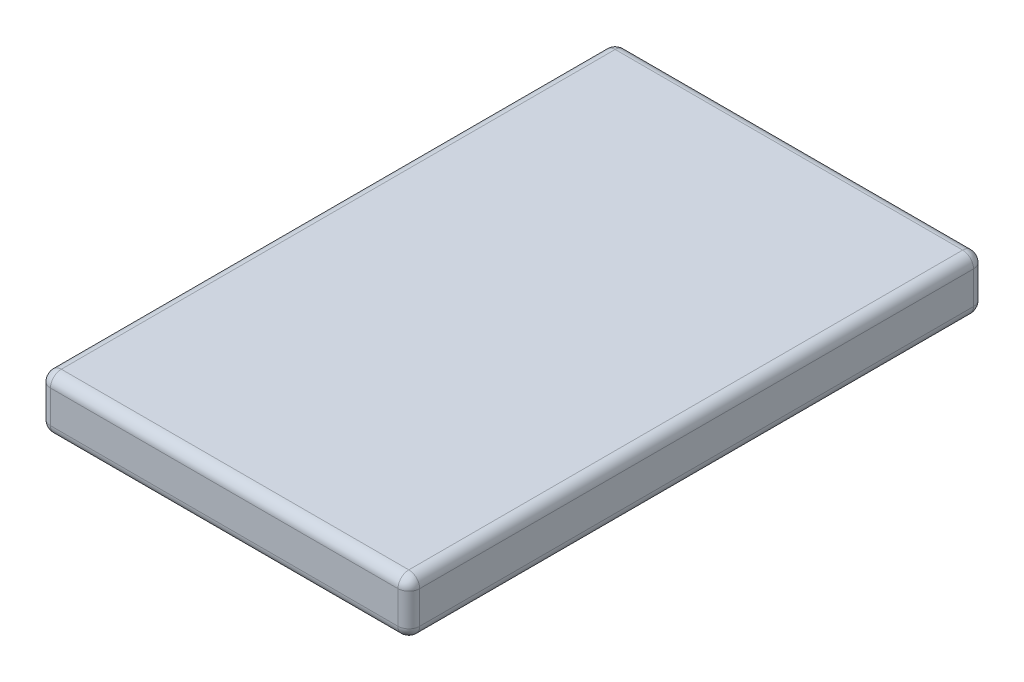
ISO-10303-21;
HEADER;
FILE_DESCRIPTION(('STEP AP214'),'2;1');
FILE_NAME('part.step','',(''),(''),'','','');
FILE_SCHEMA(('AUTOMOTIVE_DESIGN { 1 0 10303 214 1 1 1 1 }'));
ENDSEC;
DATA;
#1=APPLICATION_CONTEXT('core data for automotive mechanical design processes');
#2=APPLICATION_PROTOCOL_DEFINITION('international standard','automotive_design',2000,#1);
#3=PRODUCT_CONTEXT('',#1,'mechanical');
#4=PRODUCT('Part','Part','',(#3));
#5=PRODUCT_RELATED_PRODUCT_CATEGORY('part','',(#4));
#6=PRODUCT_DEFINITION_FORMATION('','',#4);
#7=PRODUCT_DEFINITION_CONTEXT('part definition',#1,'design');
#8=PRODUCT_DEFINITION('design','',#6,#7);
#9=PRODUCT_DEFINITION_SHAPE('','',#8);
#10=(LENGTH_UNIT() NAMED_UNIT(*) SI_UNIT(.MILLI.,.METRE.));
#11=(NAMED_UNIT(*) PLANE_ANGLE_UNIT() SI_UNIT($,.RADIAN.));
#12=(NAMED_UNIT(*) SI_UNIT($,.STERADIAN.) SOLID_ANGLE_UNIT());
#13=UNCERTAINTY_MEASURE_WITH_UNIT(LENGTH_MEASURE(1.E-05),#10,'distance_accuracy_value','');
#14=(GEOMETRIC_REPRESENTATION_CONTEXT(3) GLOBAL_UNCERTAINTY_ASSIGNED_CONTEXT((#13)) GLOBAL_UNIT_ASSIGNED_CONTEXT((#10,
#11,#12)) REPRESENTATION_CONTEXT('',''));
#15=CARTESIAN_POINT('',(0.,0.,0.));
#16=DIRECTION('',(0.,0.,1.));
#17=DIRECTION('',(1.,0.,0.));
#18=AXIS2_PLACEMENT_3D('',#15,#16,#17);
#19=CARTESIAN_POINT('',(17.,5.,-26.5));
#20=DIRECTION('',(-1.,0.,0.));
#21=DIRECTION('',(0.,0.,1.));
#22=AXIS2_PLACEMENT_3D('',#19,#20,#21);
#23=PLANE('',#22);
#24=DIRECTION('',(0.,0.,-1.));
#25=VECTOR('',#24,1.);
#26=CARTESIAN_POINT('',(17.,4.,26.5));
#27=LINE('',#26,#25);
#28=CARTESIAN_POINT('',(17.,4.,-25.5));
#29=VERTEX_POINT('',#28);
#30=CARTESIAN_POINT('',(17.,4.,25.5));
#31=VERTEX_POINT('',#30);
#32=EDGE_CURVE('E262',#29,#31,#27,.F.);
#33=ORIENTED_EDGE('',*,*,#32,.T.);
#34=DIRECTION('',(0.,-1.,0.));
#35=VECTOR('',#34,1.);
#36=CARTESIAN_POINT('',(17.,5.,25.5));
#37=LINE('',#36,#35);
#38=CARTESIAN_POINT('',(17.,1.,25.5));
#39=VERTEX_POINT('',#38);
#40=EDGE_CURVE('E240',#31,#39,#37,.T.);
#41=ORIENTED_EDGE('',*,*,#40,.T.);
#42=DIRECTION('',(0.,0.,-1.));
#43=VECTOR('',#42,1.);
#44=CARTESIAN_POINT('',(17.,1.,-26.5));
#45=LINE('',#44,#43);
#46=CARTESIAN_POINT('',(17.,1.,-25.5));
#47=VERTEX_POINT('',#46);
#48=EDGE_CURVE('E259',#39,#47,#45,.T.);
#49=ORIENTED_EDGE('',*,*,#48,.T.);
#50=DIRECTION('',(0.,-1.,0.));
#51=VECTOR('',#50,1.);
#52=CARTESIAN_POINT('',(17.,5.,-25.5));
#53=LINE('',#52,#51);
#54=EDGE_CURVE('E242',#47,#29,#53,.F.);
#55=ORIENTED_EDGE('',*,*,#54,.T.);
#56=EDGE_LOOP('',(#33,#41,#49,#55));
#57=FACE_BOUND('',#56,.T.);
#58=ADVANCED_FACE('F49',(#57),#23,.F.);
#59=CARTESIAN_POINT('',(-17.,5.,-26.5));
#60=DIRECTION('',(0.,0.,1.));
#61=DIRECTION('',(1.,0.,0.));
#62=AXIS2_PLACEMENT_3D('',#59,#60,#61);
#63=PLANE('',#62);
#64=DIRECTION('',(-1.,0.,0.));
#65=VECTOR('',#64,1.);
#66=CARTESIAN_POINT('',(16.,4.,-26.5));
#67=LINE('',#66,#65);
#68=CARTESIAN_POINT('',(-16.,4.,-26.5));
#69=VERTEX_POINT('',#68);
#70=CARTESIAN_POINT('',(16.,4.,-26.5));
#71=VERTEX_POINT('',#70);
#72=EDGE_CURVE('E58',#69,#71,#67,.F.);
#73=ORIENTED_EDGE('',*,*,#72,.T.);
#74=DIRECTION('',(0.,-1.,0.));
#75=VECTOR('',#74,1.);
#76=CARTESIAN_POINT('',(16.,5.,-26.5));
#77=LINE('',#76,#75);
#78=CARTESIAN_POINT('',(16.,1.,-26.5));
#79=VERTEX_POINT('',#78);
#80=EDGE_CURVE('E11',#71,#79,#77,.T.);
#81=ORIENTED_EDGE('',*,*,#80,.T.);
#82=DIRECTION('',(-1.,0.,0.));
#83=VECTOR('',#82,1.);
#84=CARTESIAN_POINT('',(-17.,1.,-26.5));
#85=LINE('',#84,#83);
#86=CARTESIAN_POINT('',(-16.,1.,-26.5));
#87=VERTEX_POINT('',#86);
#88=EDGE_CURVE('E150',#79,#87,#85,.T.);
#89=ORIENTED_EDGE('',*,*,#88,.T.);
#90=DIRECTION('',(0.,-1.,0.));
#91=VECTOR('',#90,1.);
#92=CARTESIAN_POINT('',(-16.,5.,-26.5));
#93=LINE('',#92,#91);
#94=EDGE_CURVE('E69',#87,#69,#93,.F.);
#95=ORIENTED_EDGE('',*,*,#94,.T.);
#96=EDGE_LOOP('',(#73,#81,#89,#95));
#97=FACE_BOUND('',#96,.T.);
#98=ADVANCED_FACE('F340',(#97),#63,.F.);
#99=CARTESIAN_POINT('',(-17.,5.,-26.5));
#100=DIRECTION('',(1.,0.,0.));
#101=DIRECTION('',(0.,0.,-1.));
#102=AXIS2_PLACEMENT_3D('',#99,#100,#101);
#103=PLANE('',#102);
#104=DIRECTION('',(0.,0.,1.));
#105=VECTOR('',#104,1.);
#106=CARTESIAN_POINT('',(-17.,1.,-26.5));
#107=LINE('',#106,#105);
#108=CARTESIAN_POINT('',(-17.,1.,-25.5));
#109=VERTEX_POINT('',#108);
#110=CARTESIAN_POINT('',(-17.,1.,25.5));
#111=VERTEX_POINT('',#110);
#112=EDGE_CURVE('E145',#109,#111,#107,.T.);
#113=ORIENTED_EDGE('',*,*,#112,.T.);
#114=DIRECTION('',(0.,-1.,0.));
#115=VECTOR('',#114,1.);
#116=CARTESIAN_POINT('',(-17.,5.,25.5));
#117=LINE('',#116,#115);
#118=CARTESIAN_POINT('',(-17.,4.,25.5));
#119=VERTEX_POINT('',#118);
#120=EDGE_CURVE('E139',#111,#119,#117,.F.);
#121=ORIENTED_EDGE('',*,*,#120,.T.);
#122=DIRECTION('',(0.,0.,1.));
#123=VECTOR('',#122,1.);
#124=CARTESIAN_POINT('',(-17.,4.,-26.5));
#125=LINE('',#124,#123);
#126=CARTESIAN_POINT('',(-17.,4.,-25.5));
#127=VERTEX_POINT('',#126);
#128=EDGE_CURVE('E142',#119,#127,#125,.F.);
#129=ORIENTED_EDGE('',*,*,#128,.T.);
#130=DIRECTION('',(0.,-1.,0.));
#131=VECTOR('',#130,1.);
#132=CARTESIAN_POINT('',(-17.,5.,-25.5));
#133=LINE('',#132,#131);
#134=EDGE_CURVE('E151',#127,#109,#133,.T.);
#135=ORIENTED_EDGE('',*,*,#134,.T.);
#136=EDGE_LOOP('',(#113,#121,#129,#135));
#137=FACE_BOUND('',#136,.T.);
#138=ADVANCED_FACE('F141',(#137),#103,.F.);
#139=CARTESIAN_POINT('',(-17.,5.,26.5));
#140=DIRECTION('',(0.,0.,-1.));
#141=DIRECTION('',(-1.,0.,0.));
#142=AXIS2_PLACEMENT_3D('',#139,#140,#141);
#143=PLANE('',#142);
#144=DIRECTION('',(0.,-1.,0.));
#145=VECTOR('',#144,1.);
#146=CARTESIAN_POINT('',(16.,5.,26.5));
#147=LINE('',#146,#145);
#148=CARTESIAN_POINT('',(16.,1.,26.5));
#149=VERTEX_POINT('',#148);
#150=CARTESIAN_POINT('',(16.,4.,26.5));
#151=VERTEX_POINT('',#150);
#152=EDGE_CURVE('E250',#149,#151,#147,.F.);
#153=ORIENTED_EDGE('',*,*,#152,.T.);
#154=DIRECTION('',(1.,0.,0.));
#155=VECTOR('',#154,1.);
#156=CARTESIAN_POINT('',(-16.,4.,26.5));
#157=LINE('',#156,#155);
#158=CARTESIAN_POINT('',(-16.,4.,26.5));
#159=VERTEX_POINT('',#158);
#160=EDGE_CURVE('E248',#151,#159,#157,.F.);
#161=ORIENTED_EDGE('',*,*,#160,.T.);
#162=DIRECTION('',(0.,-1.,0.));
#163=VECTOR('',#162,1.);
#164=CARTESIAN_POINT('',(-16.,5.,26.5));
#165=LINE('',#164,#163);
#166=CARTESIAN_POINT('',(-16.,1.,26.5));
#167=VERTEX_POINT('',#166);
#168=EDGE_CURVE('E174',#159,#167,#165,.T.);
#169=ORIENTED_EDGE('',*,*,#168,.T.);
#170=DIRECTION('',(1.,0.,0.));
#171=VECTOR('',#170,1.);
#172=CARTESIAN_POINT('',(-17.,1.,26.5));
#173=LINE('',#172,#171);
#174=EDGE_CURVE('E252',#167,#149,#173,.T.);
#175=ORIENTED_EDGE('',*,*,#174,.T.);
#176=EDGE_LOOP('',(#153,#161,#169,#175));
#177=FACE_BOUND('',#176,.T.);
#178=ADVANCED_FACE('F330',(#177),#143,.F.);
#179=CARTESIAN_POINT('',(0.,5.,0.));
#180=DIRECTION('',(0.,1.,0.));
#181=DIRECTION('',(0.,0.,1.));
#182=AXIS2_PLACEMENT_3D('',#179,#180,#181);
#183=PLANE('',#182);
#184=DIRECTION('',(0.,0.,1.));
#185=VECTOR('',#184,1.);
#186=CARTESIAN_POINT('',(-16.,5.,26.5));
#187=LINE('',#186,#185);
#188=CARTESIAN_POINT('',(-16.,5.,-25.5));
#189=VERTEX_POINT('',#188);
#190=CARTESIAN_POINT('',(-16.,5.,25.5));
#191=VERTEX_POINT('',#190);
#192=EDGE_CURVE('E265',#189,#191,#187,.T.);
#193=ORIENTED_EDGE('',*,*,#192,.T.);
#194=DIRECTION('',(1.,0.,0.));
#195=VECTOR('',#194,1.);
#196=CARTESIAN_POINT('',(16.,5.,25.5));
#197=LINE('',#196,#195);
#198=CARTESIAN_POINT('',(16.,5.,25.5));
#199=VERTEX_POINT('',#198);
#200=EDGE_CURVE('E255',#191,#199,#197,.T.);
#201=ORIENTED_EDGE('',*,*,#200,.T.);
#202=DIRECTION('',(0.,0.,-1.));
#203=VECTOR('',#202,1.);
#204=CARTESIAN_POINT('',(16.,5.,-26.5));
#205=LINE('',#204,#203);
#206=CARTESIAN_POINT('',(16.,5.,-25.5));
#207=VERTEX_POINT('',#206);
#208=EDGE_CURVE('E267',#199,#207,#205,.T.);
#209=ORIENTED_EDGE('',*,*,#208,.T.);
#210=DIRECTION('',(-1.,0.,0.));
#211=VECTOR('',#210,1.);
#212=CARTESIAN_POINT('',(-16.,5.,-25.5));
#213=LINE('',#212,#211);
#214=EDGE_CURVE('E170',#207,#189,#213,.T.);
#215=ORIENTED_EDGE('',*,*,#214,.T.);
#216=EDGE_LOOP('',(#193,#201,#209,#215));
#217=FACE_BOUND('',#216,.T.);
#218=ADVANCED_FACE('F332',(#217),#183,.T.);
#219=CARTESIAN_POINT('',(0.,0.,0.));
#220=DIRECTION('',(0.,1.,0.));
#221=DIRECTION('',(0.,0.,1.));
#222=AXIS2_PLACEMENT_3D('',#219,#220,#221);
#223=PLANE('',#222);
#224=DIRECTION('',(0.,0.,-1.));
#225=VECTOR('',#224,1.);
#226=CARTESIAN_POINT('',(16.,0.,0.));
#227=LINE('',#226,#225);
#228=CARTESIAN_POINT('',(16.,0.,-25.5));
#229=VERTEX_POINT('',#228);
#230=CARTESIAN_POINT('',(16.,0.,25.5));
#231=VERTEX_POINT('',#230);
#232=EDGE_CURVE('E273',#229,#231,#227,.F.);
#233=ORIENTED_EDGE('',*,*,#232,.T.);
#234=DIRECTION('',(1.,0.,0.));
#235=VECTOR('',#234,1.);
#236=CARTESIAN_POINT('',(0.,0.,25.5));
#237=LINE('',#236,#235);
#238=CARTESIAN_POINT('',(-16.,0.,25.5));
#239=VERTEX_POINT('',#238);
#240=EDGE_CURVE('E231',#231,#239,#237,.F.);
#241=ORIENTED_EDGE('',*,*,#240,.T.);
#242=DIRECTION('',(0.,0.,1.));
#243=VECTOR('',#242,1.);
#244=CARTESIAN_POINT('',(-16.,0.,0.));
#245=LINE('',#244,#243);
#246=CARTESIAN_POINT('',(-16.,0.,-25.5));
#247=VERTEX_POINT('',#246);
#248=EDGE_CURVE('E270',#239,#247,#245,.F.);
#249=ORIENTED_EDGE('',*,*,#248,.T.);
#250=DIRECTION('',(-1.,0.,0.));
#251=VECTOR('',#250,1.);
#252=CARTESIAN_POINT('',(0.,0.,-25.5));
#253=LINE('',#252,#251);
#254=EDGE_CURVE('E233',#247,#229,#253,.F.);
#255=ORIENTED_EDGE('',*,*,#254,.T.);
#256=EDGE_LOOP('',(#233,#241,#249,#255));
#257=FACE_BOUND('',#256,.T.);
#258=ADVANCED_FACE('F279',(#257),#223,.F.);
#259=CARTESIAN_POINT('',(-16.,1.,-26.5));
#260=DIRECTION('',(0.,0.,1.));
#261=DIRECTION('',(1.,0.,0.));
#262=AXIS2_PLACEMENT_3D('',#259,#260,#261);
#263=CYLINDRICAL_SURFACE('',#262,1.);
#264=ORIENTED_EDGE('',*,*,#248,.F.);
#265=CARTESIAN_POINT('',(-16.,1.,25.5));
#266=DIRECTION('',(0.,0.,1.));
#267=DIRECTION('',(1.,0.,0.));
#268=AXIS2_PLACEMENT_3D('',#265,#266,#267);
#269=CIRCLE('',#268,1.);
#270=EDGE_CURVE('E227',#239,#111,#269,.F.);
#271=ORIENTED_EDGE('',*,*,#270,.T.);
#272=ORIENTED_EDGE('',*,*,#112,.F.);
#273=CARTESIAN_POINT('',(-16.,1.,-25.5));
#274=DIRECTION('',(0.,0.,1.));
#275=DIRECTION('',(1.,0.,0.));
#276=AXIS2_PLACEMENT_3D('',#273,#274,#275);
#277=CIRCLE('',#276,1.);
#278=EDGE_CURVE('E229',#109,#247,#277,.T.);
#279=ORIENTED_EDGE('',*,*,#278,.T.);
#280=EDGE_LOOP('',(#264,#271,#272,#279));
#281=FACE_BOUND('',#280,.T.);
#282=ADVANCED_FACE('F298',(#281),#263,.T.);
#283=CARTESIAN_POINT('',(-16.,4.,0.));
#284=DIRECTION('',(0.,0.,-1.));
#285=DIRECTION('',(-1.,0.,0.));
#286=AXIS2_PLACEMENT_3D('',#283,#284,#285);
#287=CYLINDRICAL_SURFACE('',#286,1.);
#288=ORIENTED_EDGE('',*,*,#128,.F.);
#289=CARTESIAN_POINT('',(-16.,4.,25.5));
#290=DIRECTION('',(0.,0.,-1.));
#291=DIRECTION('',(-1.,0.,0.));
#292=AXIS2_PLACEMENT_3D('',#289,#290,#291);
#293=CIRCLE('',#292,1.);
#294=EDGE_CURVE('E158',#119,#191,#293,.T.);
#295=ORIENTED_EDGE('',*,*,#294,.T.);
#296=ORIENTED_EDGE('',*,*,#192,.F.);
#297=CARTESIAN_POINT('',(-16.,4.,-25.5));
#298=DIRECTION('',(0.,0.,-1.));
#299=DIRECTION('',(-1.,0.,0.));
#300=AXIS2_PLACEMENT_3D('',#297,#298,#299);
#301=CIRCLE('',#300,1.);
#302=EDGE_CURVE('E161',#189,#127,#301,.F.);
#303=ORIENTED_EDGE('',*,*,#302,.T.);
#304=EDGE_LOOP('',(#288,#295,#296,#303));
#305=FACE_BOUND('',#304,.T.);
#306=ADVANCED_FACE('F156',(#305),#287,.T.);
#307=CARTESIAN_POINT('',(16.,1.,-26.5));
#308=DIRECTION('',(0.,0.,-1.));
#309=DIRECTION('',(-1.,0.,0.));
#310=AXIS2_PLACEMENT_3D('',#307,#308,#309);
#311=CYLINDRICAL_SURFACE('',#310,1.);
#312=ORIENTED_EDGE('',*,*,#48,.F.);
#313=CARTESIAN_POINT('',(16.,1.,25.5));
#314=DIRECTION('',(0.,0.,-1.));
#315=DIRECTION('',(-1.,0.,0.));
#316=AXIS2_PLACEMENT_3D('',#313,#314,#315);
#317=CIRCLE('',#316,1.);
#318=EDGE_CURVE('E235',#39,#231,#317,.T.);
#319=ORIENTED_EDGE('',*,*,#318,.T.);
#320=ORIENTED_EDGE('',*,*,#232,.F.);
#321=CARTESIAN_POINT('',(16.,1.,-25.5));
#322=DIRECTION('',(0.,0.,-1.));
#323=DIRECTION('',(-1.,0.,0.));
#324=AXIS2_PLACEMENT_3D('',#321,#322,#323);
#325=CIRCLE('',#324,1.);
#326=EDGE_CURVE('E237',#229,#47,#325,.F.);
#327=ORIENTED_EDGE('',*,*,#326,.T.);
#328=EDGE_LOOP('',(#312,#319,#320,#327));
#329=FACE_BOUND('',#328,.T.);
#330=ADVANCED_FACE('F317',(#329),#311,.T.);
#331=CARTESIAN_POINT('',(16.,4.,0.));
#332=DIRECTION('',(0.,0.,1.));
#333=DIRECTION('',(1.,0.,0.));
#334=AXIS2_PLACEMENT_3D('',#331,#332,#333);
#335=CYLINDRICAL_SURFACE('',#334,1.);
#336=ORIENTED_EDGE('',*,*,#208,.F.);
#337=CARTESIAN_POINT('',(16.,4.,25.5));
#338=DIRECTION('',(0.,0.,1.));
#339=DIRECTION('',(1.,0.,0.));
#340=AXIS2_PLACEMENT_3D('',#337,#338,#339);
#341=CIRCLE('',#340,1.);
#342=EDGE_CURVE('E244',#199,#31,#341,.F.);
#343=ORIENTED_EDGE('',*,*,#342,.T.);
#344=ORIENTED_EDGE('',*,*,#32,.F.);
#345=CARTESIAN_POINT('',(16.,4.,-25.5));
#346=DIRECTION('',(0.,0.,1.));
#347=DIRECTION('',(1.,0.,0.));
#348=AXIS2_PLACEMENT_3D('',#345,#346,#347);
#349=CIRCLE('',#348,1.);
#350=EDGE_CURVE('E246',#29,#207,#349,.T.);
#351=ORIENTED_EDGE('',*,*,#350,.T.);
#352=EDGE_LOOP('',(#336,#343,#344,#351));
#353=FACE_BOUND('',#352,.T.);
#354=ADVANCED_FACE('F356',(#353),#335,.T.);
#355=CARTESIAN_POINT('',(16.,1.,25.5));
#356=DIRECTION('',(0.,0.,-1.));
#357=DIRECTION('',(-1.,0.,0.));
#358=AXIS2_PLACEMENT_3D('',#355,#356,#357);
#359=SPHERICAL_SURFACE('',#358,1.);
#360=CARTESIAN_POINT('',(16.,1.,25.5));
#361=DIRECTION('',(-1.,0.,0.));
#362=DIRECTION('',(0.,0.,1.));
#363=AXIS2_PLACEMENT_3D('',#360,#361,#362);
#364=CIRCLE('',#363,1.);
#365=EDGE_CURVE('E193',#231,#149,#364,.T.);
#366=ORIENTED_EDGE('',*,*,#365,.F.);
#367=ORIENTED_EDGE('',*,*,#318,.F.);
#368=CARTESIAN_POINT('',(16.,1.,25.5));
#369=DIRECTION('',(0.,1.,0.));
#370=DIRECTION('',(0.,0.,1.));
#371=AXIS2_PLACEMENT_3D('',#368,#369,#370);
#372=CIRCLE('',#371,1.);
#373=EDGE_CURVE('E162',#149,#39,#372,.T.);
#374=ORIENTED_EDGE('',*,*,#373,.F.);
#375=EDGE_LOOP('',(#366,#367,#374));
#376=FACE_BOUND('',#375,.T.);
#377=ADVANCED_FACE('F288',(#376),#359,.T.);
#378=CARTESIAN_POINT('',(16.,5.,25.5));
#379=DIRECTION('',(0.,-1.,0.));
#380=DIRECTION('',(0.,0.,-1.));
#381=AXIS2_PLACEMENT_3D('',#378,#379,#380);
#382=CYLINDRICAL_SURFACE('',#381,1.);
#383=ORIENTED_EDGE('',*,*,#373,.T.);
#384=ORIENTED_EDGE('',*,*,#40,.F.);
#385=CARTESIAN_POINT('',(16.,4.,25.5));
#386=DIRECTION('',(0.,1.,0.));
#387=DIRECTION('',(0.,0.,1.));
#388=AXIS2_PLACEMENT_3D('',#385,#386,#387);
#389=CIRCLE('',#388,1.);
#390=EDGE_CURVE('E190',#151,#31,#389,.T.);
#391=ORIENTED_EDGE('',*,*,#390,.F.);
#392=ORIENTED_EDGE('',*,*,#152,.F.);
#393=EDGE_LOOP('',(#383,#384,#391,#392));
#394=FACE_BOUND('',#393,.T.);
#395=ADVANCED_FACE('F321',(#394),#382,.T.);
#396=CARTESIAN_POINT('',(-17.,1.,25.5));
#397=DIRECTION('',(1.,0.,0.));
#398=DIRECTION('',(0.,0.,-1.));
#399=AXIS2_PLACEMENT_3D('',#396,#397,#398);
#400=CYLINDRICAL_SURFACE('',#399,1.);
#401=ORIENTED_EDGE('',*,*,#365,.T.);
#402=ORIENTED_EDGE('',*,*,#174,.F.);
#403=CARTESIAN_POINT('',(-16.,1.,25.5));
#404=DIRECTION('',(-1.,0.,0.));
#405=DIRECTION('',(0.,0.,1.));
#406=AXIS2_PLACEMENT_3D('',#403,#404,#405);
#407=CIRCLE('',#406,1.);
#408=EDGE_CURVE('E187',#239,#167,#407,.T.);
#409=ORIENTED_EDGE('',*,*,#408,.F.);
#410=ORIENTED_EDGE('',*,*,#240,.F.);
#411=EDGE_LOOP('',(#401,#402,#409,#410));
#412=FACE_BOUND('',#411,.T.);
#413=ADVANCED_FACE('F293',(#412),#400,.T.);
#414=CARTESIAN_POINT('',(16.,4.,25.5));
#415=DIRECTION('',(0.,0.,-1.));
#416=DIRECTION('',(-1.,0.,0.));
#417=AXIS2_PLACEMENT_3D('',#414,#415,#416);
#418=SPHERICAL_SURFACE('',#417,1.);
#419=ORIENTED_EDGE('',*,*,#390,.T.);
#420=ORIENTED_EDGE('',*,*,#342,.F.);
#421=CARTESIAN_POINT('',(16.,4.,25.5));
#422=DIRECTION('',(-1.,0.,0.));
#423=DIRECTION('',(0.,0.,1.));
#424=AXIS2_PLACEMENT_3D('',#421,#422,#423);
#425=CIRCLE('',#424,1.);
#426=EDGE_CURVE('E184',#151,#199,#425,.T.);
#427=ORIENTED_EDGE('',*,*,#426,.F.);
#428=EDGE_LOOP('',(#419,#420,#427));
#429=FACE_BOUND('',#428,.T.);
#430=ADVANCED_FACE('F325',(#429),#418,.T.);
#431=CARTESIAN_POINT('',(-16.,1.,25.5));
#432=DIRECTION('',(0.,0.,-1.));
#433=DIRECTION('',(-1.,0.,0.));
#434=AXIS2_PLACEMENT_3D('',#431,#432,#433);
#435=SPHERICAL_SURFACE('',#434,1.);
#436=ORIENTED_EDGE('',*,*,#270,.F.);
#437=ORIENTED_EDGE('',*,*,#408,.T.);
#438=CARTESIAN_POINT('',(-16.,1.,25.5));
#439=DIRECTION('',(0.,1.,0.));
#440=DIRECTION('',(0.,0.,1.));
#441=AXIS2_PLACEMENT_3D('',#438,#439,#440);
#442=CIRCLE('',#441,1.);
#443=EDGE_CURVE('E177',#111,#167,#442,.T.);
#444=ORIENTED_EDGE('',*,*,#443,.F.);
#445=EDGE_LOOP('',(#436,#437,#444));
#446=FACE_BOUND('',#445,.T.);
#447=ADVANCED_FACE('F296',(#446),#435,.T.);
#448=CARTESIAN_POINT('',(0.,4.,25.5));
#449=DIRECTION('',(-1.,0.,0.));
#450=DIRECTION('',(0.,0.,1.));
#451=AXIS2_PLACEMENT_3D('',#448,#449,#450);
#452=CYLINDRICAL_SURFACE('',#451,1.);
#453=ORIENTED_EDGE('',*,*,#426,.T.);
#454=ORIENTED_EDGE('',*,*,#200,.F.);
#455=CARTESIAN_POINT('',(-16.,4.,25.5));
#456=DIRECTION('',(-1.,0.,0.));
#457=DIRECTION('',(0.,0.,1.));
#458=AXIS2_PLACEMENT_3D('',#455,#456,#457);
#459=CIRCLE('',#458,1.);
#460=EDGE_CURVE('E168',#159,#191,#459,.T.);
#461=ORIENTED_EDGE('',*,*,#460,.F.);
#462=ORIENTED_EDGE('',*,*,#160,.F.);
#463=EDGE_LOOP('',(#453,#454,#461,#462));
#464=FACE_BOUND('',#463,.T.);
#465=ADVANCED_FACE('F328',(#464),#452,.T.);
#466=CARTESIAN_POINT('',(-16.,5.,25.5));
#467=DIRECTION('',(0.,-1.,0.));
#468=DIRECTION('',(0.,0.,-1.));
#469=AXIS2_PLACEMENT_3D('',#466,#467,#468);
#470=CYLINDRICAL_SURFACE('',#469,1.);
#471=ORIENTED_EDGE('',*,*,#443,.T.);
#472=ORIENTED_EDGE('',*,*,#168,.F.);
#473=CARTESIAN_POINT('',(-16.,4.,25.5));
#474=DIRECTION('',(0.,1.,0.));
#475=DIRECTION('',(0.,0.,1.));
#476=AXIS2_PLACEMENT_3D('',#473,#474,#475);
#477=CIRCLE('',#476,1.);
#478=EDGE_CURVE('E166',#119,#159,#477,.T.);
#479=ORIENTED_EDGE('',*,*,#478,.F.);
#480=ORIENTED_EDGE('',*,*,#120,.F.);
#481=EDGE_LOOP('',(#471,#472,#479,#480));
#482=FACE_BOUND('',#481,.T.);
#483=ADVANCED_FACE('F173',(#482),#470,.T.);
#484=CARTESIAN_POINT('',(-16.,4.,25.5));
#485=DIRECTION('',(0.,0.,-1.));
#486=DIRECTION('',(-1.,0.,0.));
#487=AXIS2_PLACEMENT_3D('',#484,#485,#486);
#488=SPHERICAL_SURFACE('',#487,1.);
#489=ORIENTED_EDGE('',*,*,#460,.T.);
#490=ORIENTED_EDGE('',*,*,#294,.F.);
#491=ORIENTED_EDGE('',*,*,#478,.T.);
#492=EDGE_LOOP('',(#489,#490,#491));
#493=FACE_BOUND('',#492,.T.);
#494=ADVANCED_FACE('F165',(#493),#488,.T.);
#495=CARTESIAN_POINT('',(-16.,4.,-25.5));
#496=DIRECTION('',(0.,0.,1.));
#497=DIRECTION('',(1.,0.,0.));
#498=AXIS2_PLACEMENT_3D('',#495,#496,#497);
#499=SPHERICAL_SURFACE('',#498,1.);
#500=CARTESIAN_POINT('',(-16.,4.,-25.5));
#501=DIRECTION('',(0.,-1.,0.));
#502=DIRECTION('',(0.,0.,-1.));
#503=AXIS2_PLACEMENT_3D('',#500,#501,#502);
#504=CIRCLE('',#503,1.);
#505=EDGE_CURVE('E180',#127,#69,#504,.T.);
#506=ORIENTED_EDGE('',*,*,#505,.F.);
#507=ORIENTED_EDGE('',*,*,#302,.F.);
#508=CARTESIAN_POINT('',(-16.,4.,-25.5));
#509=DIRECTION('',(1.,0.,0.));
#510=DIRECTION('',(0.,0.,-1.));
#511=AXIS2_PLACEMENT_3D('',#508,#509,#510);
#512=CIRCLE('',#511,1.);
#513=EDGE_CURVE('E53',#69,#189,#512,.T.);
#514=ORIENTED_EDGE('',*,*,#513,.F.);
#515=EDGE_LOOP('',(#506,#507,#514));
#516=FACE_BOUND('',#515,.T.);
#517=ADVANCED_FACE('F51',(#516),#499,.T.);
#518=CARTESIAN_POINT('',(0.,4.,-25.5));
#519=DIRECTION('',(1.,0.,0.));
#520=DIRECTION('',(0.,0.,-1.));
#521=AXIS2_PLACEMENT_3D('',#518,#519,#520);
#522=CYLINDRICAL_SURFACE('',#521,1.);
#523=ORIENTED_EDGE('',*,*,#513,.T.);
#524=ORIENTED_EDGE('',*,*,#214,.F.);
#525=CARTESIAN_POINT('',(16.,4.,-25.5));
#526=DIRECTION('',(1.,0.,0.));
#527=DIRECTION('',(0.,0.,-1.));
#528=AXIS2_PLACEMENT_3D('',#525,#526,#527);
#529=CIRCLE('',#528,1.);
#530=EDGE_CURVE('E211',#71,#207,#529,.T.);
#531=ORIENTED_EDGE('',*,*,#530,.F.);
#532=ORIENTED_EDGE('',*,*,#72,.F.);
#533=EDGE_LOOP('',(#523,#524,#531,#532));
#534=FACE_BOUND('',#533,.T.);
#535=ADVANCED_FACE('F221',(#534),#522,.T.);
#536=CARTESIAN_POINT('',(-16.,5.,-25.5));
#537=DIRECTION('',(0.,-1.,0.));
#538=DIRECTION('',(0.,0.,-1.));
#539=AXIS2_PLACEMENT_3D('',#536,#537,#538);
#540=CYLINDRICAL_SURFACE('',#539,1.);
#541=ORIENTED_EDGE('',*,*,#505,.T.);
#542=ORIENTED_EDGE('',*,*,#94,.F.);
#543=CARTESIAN_POINT('',(-16.,1.,-25.5));
#544=DIRECTION('',(0.,-1.,0.));
#545=DIRECTION('',(0.,0.,-1.));
#546=AXIS2_PLACEMENT_3D('',#543,#544,#545);
#547=CIRCLE('',#546,1.);
#548=EDGE_CURVE('E208',#109,#87,#547,.T.);
#549=ORIENTED_EDGE('',*,*,#548,.F.);
#550=ORIENTED_EDGE('',*,*,#134,.F.);
#551=EDGE_LOOP('',(#541,#542,#549,#550));
#552=FACE_BOUND('',#551,.T.);
#553=ADVANCED_FACE('F216',(#552),#540,.T.);
#554=CARTESIAN_POINT('',(16.,4.,-25.5));
#555=DIRECTION('',(0.,0.,1.));
#556=DIRECTION('',(1.,0.,0.));
#557=AXIS2_PLACEMENT_3D('',#554,#555,#556);
#558=SPHERICAL_SURFACE('',#557,1.);
#559=ORIENTED_EDGE('',*,*,#530,.T.);
#560=ORIENTED_EDGE('',*,*,#350,.F.);
#561=CARTESIAN_POINT('',(16.,4.,-25.5));
#562=DIRECTION('',(0.,-1.,0.));
#563=DIRECTION('',(0.,0.,-1.));
#564=AXIS2_PLACEMENT_3D('',#561,#562,#563);
#565=CIRCLE('',#564,1.);
#566=EDGE_CURVE('E205',#71,#29,#565,.T.);
#567=ORIENTED_EDGE('',*,*,#566,.F.);
#568=EDGE_LOOP('',(#559,#560,#567));
#569=FACE_BOUND('',#568,.T.);
#570=ADVANCED_FACE('F384',(#569),#558,.T.);
#571=CARTESIAN_POINT('',(-16.,1.,-25.5));
#572=DIRECTION('',(0.,0.,1.));
#573=DIRECTION('',(1.,0.,0.));
#574=AXIS2_PLACEMENT_3D('',#571,#572,#573);
#575=SPHERICAL_SURFACE('',#574,1.);
#576=ORIENTED_EDGE('',*,*,#278,.F.);
#577=ORIENTED_EDGE('',*,*,#548,.T.);
#578=CARTESIAN_POINT('',(-16.,1.,-25.5));
#579=DIRECTION('',(1.,0.,0.));
#580=DIRECTION('',(0.,0.,-1.));
#581=AXIS2_PLACEMENT_3D('',#578,#579,#580);
#582=CIRCLE('',#581,1.);
#583=EDGE_CURVE('E202',#247,#87,#582,.T.);
#584=ORIENTED_EDGE('',*,*,#583,.F.);
#585=EDGE_LOOP('',(#576,#577,#584));
#586=FACE_BOUND('',#585,.T.);
#587=ADVANCED_FACE('F302',(#586),#575,.T.);
#588=CARTESIAN_POINT('',(16.,5.,-25.5));
#589=DIRECTION('',(0.,-1.,0.));
#590=DIRECTION('',(0.,0.,-1.));
#591=AXIS2_PLACEMENT_3D('',#588,#589,#590);
#592=CYLINDRICAL_SURFACE('',#591,1.);
#593=ORIENTED_EDGE('',*,*,#566,.T.);
#594=ORIENTED_EDGE('',*,*,#54,.F.);
#595=CARTESIAN_POINT('',(16.,1.,-25.5));
#596=DIRECTION('',(0.,-1.,0.));
#597=DIRECTION('',(0.,0.,-1.));
#598=AXIS2_PLACEMENT_3D('',#595,#596,#597);
#599=CIRCLE('',#598,1.);
#600=EDGE_CURVE('E200',#79,#47,#599,.T.);
#601=ORIENTED_EDGE('',*,*,#600,.F.);
#602=ORIENTED_EDGE('',*,*,#80,.F.);
#603=EDGE_LOOP('',(#593,#594,#601,#602));
#604=FACE_BOUND('',#603,.T.);
#605=ADVANCED_FACE('F313',(#604),#592,.T.);
#606=CARTESIAN_POINT('',(-17.,1.,-25.5));
#607=DIRECTION('',(-1.,0.,0.));
#608=DIRECTION('',(0.,0.,1.));
#609=AXIS2_PLACEMENT_3D('',#606,#607,#608);
#610=CYLINDRICAL_SURFACE('',#609,1.);
#611=ORIENTED_EDGE('',*,*,#583,.T.);
#612=ORIENTED_EDGE('',*,*,#88,.F.);
#613=CARTESIAN_POINT('',(16.,1.,-25.5));
#614=DIRECTION('',(1.,0.,0.));
#615=DIRECTION('',(0.,0.,-1.));
#616=AXIS2_PLACEMENT_3D('',#613,#614,#615);
#617=CIRCLE('',#616,1.);
#618=EDGE_CURVE('E198',#229,#79,#617,.T.);
#619=ORIENTED_EDGE('',*,*,#618,.F.);
#620=ORIENTED_EDGE('',*,*,#254,.F.);
#621=EDGE_LOOP('',(#611,#612,#619,#620));
#622=FACE_BOUND('',#621,.T.);
#623=ADVANCED_FACE('F306',(#622),#610,.T.);
#624=CARTESIAN_POINT('',(16.,1.,-25.5));
#625=DIRECTION('',(0.,0.,1.));
#626=DIRECTION('',(1.,0.,0.));
#627=AXIS2_PLACEMENT_3D('',#624,#625,#626);
#628=SPHERICAL_SURFACE('',#627,1.);
#629=ORIENTED_EDGE('',*,*,#600,.T.);
#630=ORIENTED_EDGE('',*,*,#326,.F.);
#631=ORIENTED_EDGE('',*,*,#618,.T.);
#632=EDGE_LOOP('',(#629,#630,#631));
#633=FACE_BOUND('',#632,.T.);
#634=ADVANCED_FACE('F309',(#633),#628,.T.);
#635=CLOSED_SHELL('',(#58,#98,#138,#178,#218,#258,#282,#306,#330,#354,#377,#395,#413,#430,#447,
#465,#483,#494,#517,#535,#553,#570,#587,#605,#623,#634));
#636=MANIFOLD_SOLID_BREP('B2',#635);
#637=ADVANCED_BREP_SHAPE_REPRESENTATION('',(#18,#636),#14);
#638=SHAPE_DEFINITION_REPRESENTATION(#9,#637);
ENDSEC;
END-ISO-10303-21;
